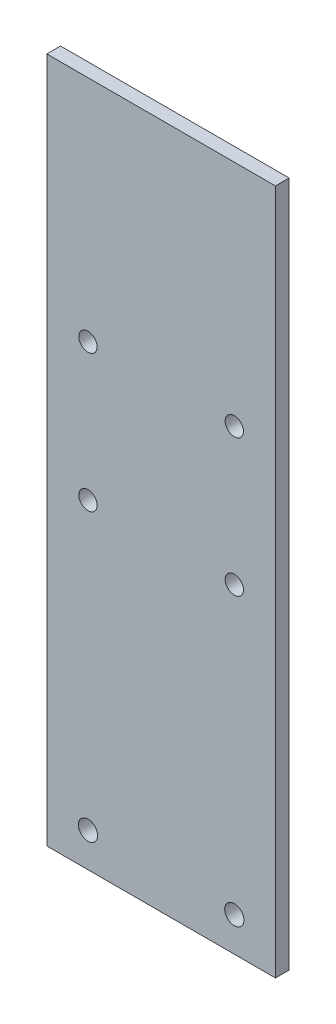
ISO-10303-21;
HEADER;
FILE_DESCRIPTION(('STEP AP214'),'2;1');
FILE_NAME('part.step','',(''),(''),'','','');
FILE_SCHEMA(('AUTOMOTIVE_DESIGN { 1 0 10303 214 1 1 1 1 }'));
ENDSEC;
DATA;
#1=APPLICATION_CONTEXT('core data for automotive mechanical design processes');
#2=APPLICATION_PROTOCOL_DEFINITION('international standard','automotive_design',2000,#1);
#3=PRODUCT_CONTEXT('',#1,'mechanical');
#4=PRODUCT('Part','Part','',(#3));
#5=PRODUCT_RELATED_PRODUCT_CATEGORY('part','',(#4));
#6=PRODUCT_DEFINITION_FORMATION('','',#4);
#7=PRODUCT_DEFINITION_CONTEXT('part definition',#1,'design');
#8=PRODUCT_DEFINITION('design','',#6,#7);
#9=PRODUCT_DEFINITION_SHAPE('','',#8);
#10=(LENGTH_UNIT() NAMED_UNIT(*) SI_UNIT(.MILLI.,.METRE.));
#11=(NAMED_UNIT(*) PLANE_ANGLE_UNIT() SI_UNIT($,.RADIAN.));
#12=(NAMED_UNIT(*) SI_UNIT($,.STERADIAN.) SOLID_ANGLE_UNIT());
#13=UNCERTAINTY_MEASURE_WITH_UNIT(LENGTH_MEASURE(1.E-05),#10,'distance_accuracy_value','');
#14=(GEOMETRIC_REPRESENTATION_CONTEXT(3) GLOBAL_UNCERTAINTY_ASSIGNED_CONTEXT((#13)) GLOBAL_UNIT_ASSIGNED_CONTEXT((#10,
#11,#12)) REPRESENTATION_CONTEXT('',''));
#15=CARTESIAN_POINT('',(0.,0.,0.));
#16=DIRECTION('',(0.,0.,1.));
#17=DIRECTION('',(1.,0.,0.));
#18=AXIS2_PLACEMENT_3D('',#15,#16,#17);
#19=CARTESIAN_POINT('',(-25.,-150.,3.));
#20=DIRECTION('',(1.,0.,0.));
#21=DIRECTION('',(0.,0.,-1.));
#22=AXIS2_PLACEMENT_3D('',#19,#20,#21);
#23=PLANE('',#22);
#24=DIRECTION('',(0.,-1.,0.));
#25=VECTOR('',#24,1.);
#26=CARTESIAN_POINT('',(-25.,-150.,0.));
#27=LINE('',#26,#25);
#28=CARTESIAN_POINT('',(-25.,0.,0.));
#29=VERTEX_POINT('',#28);
#30=CARTESIAN_POINT('',(-25.,-150.,0.));
#31=VERTEX_POINT('',#30);
#32=EDGE_CURVE('E95',#29,#31,#27,.T.);
#33=ORIENTED_EDGE('',*,*,#32,.T.);
#34=DIRECTION('',(0.,0.,-1.));
#35=VECTOR('',#34,1.);
#36=CARTESIAN_POINT('',(-25.,-150.,3.));
#37=LINE('',#36,#35);
#38=CARTESIAN_POINT('',(-25.,-150.,3.));
#39=VERTEX_POINT('',#38);
#40=EDGE_CURVE('E11',#39,#31,#37,.T.);
#41=ORIENTED_EDGE('',*,*,#40,.F.);
#42=DIRECTION('',(0.,-1.,0.));
#43=VECTOR('',#42,1.);
#44=CARTESIAN_POINT('',(-25.,-150.,3.));
#45=LINE('',#44,#43);
#46=CARTESIAN_POINT('',(-25.,0.,3.));
#47=VERTEX_POINT('',#46);
#48=EDGE_CURVE('E83',#47,#39,#45,.T.);
#49=ORIENTED_EDGE('',*,*,#48,.F.);
#50=DIRECTION('',(0.,0.,-1.));
#51=VECTOR('',#50,1.);
#52=CARTESIAN_POINT('',(-25.,0.,3.));
#53=LINE('',#52,#51);
#54=EDGE_CURVE('E91',#47,#29,#53,.T.);
#55=ORIENTED_EDGE('',*,*,#54,.T.);
#56=EDGE_LOOP('',(#33,#41,#49,#55));
#57=FACE_BOUND('',#56,.T.);
#58=ADVANCED_FACE('F32',(#57),#23,.F.);
#59=CARTESIAN_POINT('',(-25.,-150.,3.));
#60=DIRECTION('',(0.,1.,0.));
#61=DIRECTION('',(0.,0.,1.));
#62=AXIS2_PLACEMENT_3D('',#59,#60,#61);
#63=PLANE('',#62);
#64=DIRECTION('',(1.,0.,0.));
#65=VECTOR('',#64,1.);
#66=CARTESIAN_POINT('',(-25.,-150.,0.));
#67=LINE('',#66,#65);
#68=CARTESIAN_POINT('',(25.,-150.,0.));
#69=VERTEX_POINT('',#68);
#70=EDGE_CURVE('E87',#31,#69,#67,.T.);
#71=ORIENTED_EDGE('',*,*,#70,.T.);
#72=DIRECTION('',(0.,0.,-1.));
#73=VECTOR('',#72,1.);
#74=CARTESIAN_POINT('',(25.,-150.,3.));
#75=LINE('',#74,#73);
#76=CARTESIAN_POINT('',(25.,-150.,3.));
#77=VERTEX_POINT('',#76);
#78=EDGE_CURVE('E40',#77,#69,#75,.T.);
#79=ORIENTED_EDGE('',*,*,#78,.F.);
#80=DIRECTION('',(1.,0.,0.));
#81=VECTOR('',#80,1.);
#82=CARTESIAN_POINT('',(-25.,-150.,3.));
#83=LINE('',#82,#81);
#84=EDGE_CURVE('E78',#39,#77,#83,.T.);
#85=ORIENTED_EDGE('',*,*,#84,.F.);
#86=ORIENTED_EDGE('',*,*,#40,.T.);
#87=EDGE_LOOP('',(#71,#79,#85,#86));
#88=FACE_BOUND('',#87,.T.);
#89=ADVANCED_FACE('F86',(#88),#63,.F.);
#90=CARTESIAN_POINT('',(25.,-150.,3.));
#91=DIRECTION('',(-1.,0.,0.));
#92=DIRECTION('',(0.,0.,1.));
#93=AXIS2_PLACEMENT_3D('',#90,#91,#92);
#94=PLANE('',#93);
#95=DIRECTION('',(0.,1.,0.));
#96=VECTOR('',#95,1.);
#97=CARTESIAN_POINT('',(25.,-150.,0.));
#98=LINE('',#97,#96);
#99=CARTESIAN_POINT('',(25.,0.,0.));
#100=VERTEX_POINT('',#99);
#101=EDGE_CURVE('E65',#69,#100,#98,.T.);
#102=ORIENTED_EDGE('',*,*,#101,.T.);
#103=DIRECTION('',(0.,0.,-1.));
#104=VECTOR('',#103,1.);
#105=CARTESIAN_POINT('',(25.,0.,3.));
#106=LINE('',#105,#104);
#107=CARTESIAN_POINT('',(25.,0.,3.));
#108=VERTEX_POINT('',#107);
#109=EDGE_CURVE('E88',#108,#100,#106,.T.);
#110=ORIENTED_EDGE('',*,*,#109,.F.);
#111=DIRECTION('',(0.,1.,0.));
#112=VECTOR('',#111,1.);
#113=CARTESIAN_POINT('',(25.,-150.,3.));
#114=LINE('',#113,#112);
#115=EDGE_CURVE('E81',#77,#108,#114,.T.);
#116=ORIENTED_EDGE('',*,*,#115,.F.);
#117=ORIENTED_EDGE('',*,*,#78,.T.);
#118=EDGE_LOOP('',(#102,#110,#116,#117));
#119=FACE_BOUND('',#118,.T.);
#120=ADVANCED_FACE('F89',(#119),#94,.F.);
#121=CARTESIAN_POINT('',(-25.,0.,3.));
#122=DIRECTION('',(0.,-1.,0.));
#123=DIRECTION('',(1.,0.,0.));
#124=AXIS2_PLACEMENT_3D('',#121,#122,#123);
#125=PLANE('',#124);
#126=DIRECTION('',(-1.,0.,0.));
#127=VECTOR('',#126,1.);
#128=CARTESIAN_POINT('',(-25.,0.,0.));
#129=LINE('',#128,#127);
#130=EDGE_CURVE('E71',#100,#29,#129,.T.);
#131=ORIENTED_EDGE('',*,*,#130,.T.);
#132=ORIENTED_EDGE('',*,*,#54,.F.);
#133=DIRECTION('',(-1.,0.,0.));
#134=VECTOR('',#133,1.);
#135=CARTESIAN_POINT('',(-25.,0.,3.));
#136=LINE('',#135,#134);
#137=EDGE_CURVE('E48',#108,#47,#136,.T.);
#138=ORIENTED_EDGE('',*,*,#137,.F.);
#139=ORIENTED_EDGE('',*,*,#109,.T.);
#140=EDGE_LOOP('',(#131,#132,#138,#139));
#141=FACE_BOUND('',#140,.T.);
#142=ADVANCED_FACE('F103',(#141),#125,.F.);
#143=CARTESIAN_POINT('',(0.,0.,3.));
#144=DIRECTION('',(0.,0.,-1.));
#145=DIRECTION('',(-1.,0.,0.));
#146=AXIS2_PLACEMENT_3D('',#143,#144,#145);
#147=PLANE('',#146);
#148=CARTESIAN_POINT('',(-16.,-142.5,3.));
#149=DIRECTION('',(0.,0.,1.));
#150=DIRECTION('',(1.,0.,0.));
#151=AXIS2_PLACEMENT_3D('',#148,#149,#150);
#152=CIRCLE('',#151,2.09999999999998);
#153=CARTESIAN_POINT('',(-13.9,-142.5,3.));
#154=VERTEX_POINT('',#153);
#155=EDGE_CURVE('E130',#154,#154,#152,.T.);
#156=ORIENTED_EDGE('',*,*,#155,.F.);
#157=EDGE_LOOP('',(#156));
#158=FACE_BOUND('',#157,.T.);
#159=CARTESIAN_POINT('',(16.,-142.5,3.));
#160=DIRECTION('',(0.,0.,1.));
#161=DIRECTION('',(1.,0.,0.));
#162=AXIS2_PLACEMENT_3D('',#159,#160,#161);
#163=CIRCLE('',#162,2.09999999999998);
#164=CARTESIAN_POINT('',(18.1,-142.5,3.));
#165=VERTEX_POINT('',#164);
#166=EDGE_CURVE('E136',#165,#165,#163,.T.);
#167=ORIENTED_EDGE('',*,*,#166,.F.);
#168=EDGE_LOOP('',(#167));
#169=FACE_BOUND('',#168,.T.);
#170=CARTESIAN_POINT('',(16.,-50.,3.));
#171=DIRECTION('',(0.,0.,1.));
#172=DIRECTION('',(1.,0.,0.));
#173=AXIS2_PLACEMENT_3D('',#170,#171,#172);
#174=CIRCLE('',#173,2.00000000000001);
#175=CARTESIAN_POINT('',(18.,-50.,3.));
#176=VERTEX_POINT('',#175);
#177=EDGE_CURVE('E112',#176,#176,#174,.T.);
#178=ORIENTED_EDGE('',*,*,#177,.F.);
#179=EDGE_LOOP('',(#178));
#180=FACE_BOUND('',#179,.T.);
#181=CARTESIAN_POINT('',(-16.,-80.,3.));
#182=DIRECTION('',(0.,0.,1.));
#183=DIRECTION('',(1.,0.,0.));
#184=AXIS2_PLACEMENT_3D('',#181,#182,#183);
#185=CIRCLE('',#184,2.);
#186=CARTESIAN_POINT('',(-14.,-80.,3.));
#187=VERTEX_POINT('',#186);
#188=EDGE_CURVE('E118',#187,#187,#185,.T.);
#189=ORIENTED_EDGE('',*,*,#188,.F.);
#190=EDGE_LOOP('',(#189));
#191=FACE_BOUND('',#190,.T.);
#192=CARTESIAN_POINT('',(16.,-80.,3.));
#193=DIRECTION('',(0.,0.,1.));
#194=DIRECTION('',(1.,0.,0.));
#195=AXIS2_PLACEMENT_3D('',#192,#193,#194);
#196=CIRCLE('',#195,2.);
#197=CARTESIAN_POINT('',(18.,-80.,3.));
#198=VERTEX_POINT('',#197);
#199=EDGE_CURVE('E119',#198,#198,#196,.T.);
#200=ORIENTED_EDGE('',*,*,#199,.F.);
#201=EDGE_LOOP('',(#200));
#202=FACE_BOUND('',#201,.T.);
#203=CARTESIAN_POINT('',(-16.,-50.,3.));
#204=DIRECTION('',(0.,0.,1.));
#205=DIRECTION('',(1.,0.,0.));
#206=AXIS2_PLACEMENT_3D('',#203,#204,#205);
#207=CIRCLE('',#206,2.);
#208=CARTESIAN_POINT('',(-14.,-50.,3.));
#209=VERTEX_POINT('',#208);
#210=EDGE_CURVE('E98',#209,#209,#207,.T.);
#211=ORIENTED_EDGE('',*,*,#210,.F.);
#212=EDGE_LOOP('',(#211));
#213=FACE_BOUND('',#212,.T.);
#214=ORIENTED_EDGE('',*,*,#48,.T.);
#215=ORIENTED_EDGE('',*,*,#84,.T.);
#216=ORIENTED_EDGE('',*,*,#115,.T.);
#217=ORIENTED_EDGE('',*,*,#137,.T.);
#218=EDGE_LOOP('',(#214,#215,#216,#217));
#219=FACE_BOUND('',#218,.T.);
#220=ADVANCED_FACE('F79',(#158,#169,#180,#191,#202,#213,#219),#147,.F.);
#221=CARTESIAN_POINT('',(0.,0.,0.));
#222=DIRECTION('',(0.,0.,-1.));
#223=DIRECTION('',(-1.,0.,0.));
#224=AXIS2_PLACEMENT_3D('',#221,#222,#223);
#225=PLANE('',#224);
#226=CARTESIAN_POINT('',(-16.,-142.5,0.));
#227=DIRECTION('',(0.,0.,1.));
#228=DIRECTION('',(1.,0.,0.));
#229=AXIS2_PLACEMENT_3D('',#226,#227,#228);
#230=CIRCLE('',#229,2.09999999999998);
#231=CARTESIAN_POINT('',(-13.9,-142.5,0.));
#232=VERTEX_POINT('',#231);
#233=EDGE_CURVE('E139',#232,#232,#230,.T.);
#234=ORIENTED_EDGE('',*,*,#233,.T.);
#235=EDGE_LOOP('',(#234));
#236=FACE_BOUND('',#235,.T.);
#237=CARTESIAN_POINT('',(16.,-142.5,0.));
#238=DIRECTION('',(0.,0.,1.));
#239=DIRECTION('',(1.,0.,0.));
#240=AXIS2_PLACEMENT_3D('',#237,#238,#239);
#241=CIRCLE('',#240,2.09999999999998);
#242=CARTESIAN_POINT('',(18.1,-142.5,0.));
#243=VERTEX_POINT('',#242);
#244=EDGE_CURVE('E133',#243,#243,#241,.T.);
#245=ORIENTED_EDGE('',*,*,#244,.T.);
#246=EDGE_LOOP('',(#245));
#247=FACE_BOUND('',#246,.T.);
#248=CARTESIAN_POINT('',(16.,-50.,0.));
#249=DIRECTION('',(0.,0.,1.));
#250=DIRECTION('',(1.,0.,0.));
#251=AXIS2_PLACEMENT_3D('',#248,#249,#250);
#252=CIRCLE('',#251,2.00000000000001);
#253=CARTESIAN_POINT('',(18.,-50.,0.));
#254=VERTEX_POINT('',#253);
#255=EDGE_CURVE('E122',#254,#254,#252,.T.);
#256=ORIENTED_EDGE('',*,*,#255,.T.);
#257=EDGE_LOOP('',(#256));
#258=FACE_BOUND('',#257,.T.);
#259=CARTESIAN_POINT('',(-16.,-80.,0.));
#260=DIRECTION('',(0.,0.,1.));
#261=DIRECTION('',(1.,0.,0.));
#262=AXIS2_PLACEMENT_3D('',#259,#260,#261);
#263=CIRCLE('',#262,2.);
#264=CARTESIAN_POINT('',(-14.,-80.,0.));
#265=VERTEX_POINT('',#264);
#266=EDGE_CURVE('E115',#265,#265,#263,.T.);
#267=ORIENTED_EDGE('',*,*,#266,.T.);
#268=EDGE_LOOP('',(#267));
#269=FACE_BOUND('',#268,.T.);
#270=CARTESIAN_POINT('',(16.,-80.,0.));
#271=DIRECTION('',(0.,0.,1.));
#272=DIRECTION('',(1.,0.,0.));
#273=AXIS2_PLACEMENT_3D('',#270,#271,#272);
#274=CIRCLE('',#273,2.);
#275=CARTESIAN_POINT('',(18.,-80.,0.));
#276=VERTEX_POINT('',#275);
#277=EDGE_CURVE('E127',#276,#276,#274,.T.);
#278=ORIENTED_EDGE('',*,*,#277,.T.);
#279=EDGE_LOOP('',(#278));
#280=FACE_BOUND('',#279,.T.);
#281=CARTESIAN_POINT('',(-16.,-50.,0.));
#282=DIRECTION('',(0.,0.,1.));
#283=DIRECTION('',(1.,0.,0.));
#284=AXIS2_PLACEMENT_3D('',#281,#282,#283);
#285=CIRCLE('',#284,2.);
#286=CARTESIAN_POINT('',(-14.,-50.,0.));
#287=VERTEX_POINT('',#286);
#288=EDGE_CURVE('E109',#287,#287,#285,.T.);
#289=ORIENTED_EDGE('',*,*,#288,.T.);
#290=EDGE_LOOP('',(#289));
#291=FACE_BOUND('',#290,.T.);
#292=ORIENTED_EDGE('',*,*,#32,.F.);
#293=ORIENTED_EDGE('',*,*,#130,.F.);
#294=ORIENTED_EDGE('',*,*,#101,.F.);
#295=ORIENTED_EDGE('',*,*,#70,.F.);
#296=EDGE_LOOP('',(#292,#293,#294,#295));
#297=FACE_BOUND('',#296,.T.);
#298=ADVANCED_FACE('F106',(#236,#247,#258,#269,#280,#291,#297),#225,.T.);
#299=CARTESIAN_POINT('',(-16.,-50.,3.));
#300=DIRECTION('',(0.,0.,-1.));
#301=DIRECTION('',(-1.,0.,0.));
#302=AXIS2_PLACEMENT_3D('',#299,#300,#301);
#303=CYLINDRICAL_SURFACE('',#302,2.);
#304=ORIENTED_EDGE('',*,*,#210,.T.);
#305=EDGE_LOOP('',(#304));
#306=FACE_BOUND('',#305,.T.);
#307=ORIENTED_EDGE('',*,*,#288,.F.);
#308=EDGE_LOOP('',(#307));
#309=FACE_BOUND('',#308,.T.);
#310=ADVANCED_FACE('F161',(#306,#309),#303,.F.);
#311=CARTESIAN_POINT('',(16.,-80.,3.));
#312=DIRECTION('',(0.,0.,-1.));
#313=DIRECTION('',(-1.,0.,0.));
#314=AXIS2_PLACEMENT_3D('',#311,#312,#313);
#315=CYLINDRICAL_SURFACE('',#314,2.);
#316=ORIENTED_EDGE('',*,*,#199,.T.);
#317=EDGE_LOOP('',(#316));
#318=FACE_BOUND('',#317,.T.);
#319=ORIENTED_EDGE('',*,*,#277,.F.);
#320=EDGE_LOOP('',(#319));
#321=FACE_BOUND('',#320,.T.);
#322=ADVANCED_FACE('F164',(#318,#321),#315,.F.);
#323=CARTESIAN_POINT('',(-16.,-80.,3.));
#324=DIRECTION('',(0.,0.,-1.));
#325=DIRECTION('',(-1.,0.,0.));
#326=AXIS2_PLACEMENT_3D('',#323,#324,#325);
#327=CYLINDRICAL_SURFACE('',#326,2.);
#328=ORIENTED_EDGE('',*,*,#188,.T.);
#329=EDGE_LOOP('',(#328));
#330=FACE_BOUND('',#329,.T.);
#331=ORIENTED_EDGE('',*,*,#266,.F.);
#332=EDGE_LOOP('',(#331));
#333=FACE_BOUND('',#332,.T.);
#334=ADVANCED_FACE('F229',(#330,#333),#327,.F.);
#335=CARTESIAN_POINT('',(16.,-50.,3.));
#336=DIRECTION('',(0.,0.,-1.));
#337=DIRECTION('',(-1.,0.,0.));
#338=AXIS2_PLACEMENT_3D('',#335,#336,#337);
#339=CYLINDRICAL_SURFACE('',#338,2.00000000000001);
#340=ORIENTED_EDGE('',*,*,#177,.T.);
#341=EDGE_LOOP('',(#340));
#342=FACE_BOUND('',#341,.T.);
#343=ORIENTED_EDGE('',*,*,#255,.F.);
#344=EDGE_LOOP('',(#343));
#345=FACE_BOUND('',#344,.T.);
#346=ADVANCED_FACE('F199',(#342,#345),#339,.F.);
#347=CARTESIAN_POINT('',(16.,-142.5,3.));
#348=DIRECTION('',(0.,0.,-1.));
#349=DIRECTION('',(-1.,0.,0.));
#350=AXIS2_PLACEMENT_3D('',#347,#348,#349);
#351=CYLINDRICAL_SURFACE('',#350,2.09999999999998);
#352=ORIENTED_EDGE('',*,*,#166,.T.);
#353=EDGE_LOOP('',(#352));
#354=FACE_BOUND('',#353,.T.);
#355=ORIENTED_EDGE('',*,*,#244,.F.);
#356=EDGE_LOOP('',(#355));
#357=FACE_BOUND('',#356,.T.);
#358=ADVANCED_FACE('F209',(#354,#357),#351,.F.);
#359=CARTESIAN_POINT('',(-16.,-142.5,3.));
#360=DIRECTION('',(0.,0.,-1.));
#361=DIRECTION('',(-1.,0.,0.));
#362=AXIS2_PLACEMENT_3D('',#359,#360,#361);
#363=CYLINDRICAL_SURFACE('',#362,2.09999999999998);
#364=ORIENTED_EDGE('',*,*,#155,.T.);
#365=EDGE_LOOP('',(#364));
#366=FACE_BOUND('',#365,.T.);
#367=ORIENTED_EDGE('',*,*,#233,.F.);
#368=EDGE_LOOP('',(#367));
#369=FACE_BOUND('',#368,.T.);
#370=ADVANCED_FACE('F145',(#366,#369),#363,.F.);
#371=CLOSED_SHELL('',(#58,#89,#120,#142,#220,#298,#310,#322,#334,#346,#358,#370));
#372=MANIFOLD_SOLID_BREP('B2',#371);
#373=ADVANCED_BREP_SHAPE_REPRESENTATION('',(#18,#372),#14);
#374=SHAPE_DEFINITION_REPRESENTATION(#9,#373);
ENDSEC;
END-ISO-10303-21;
